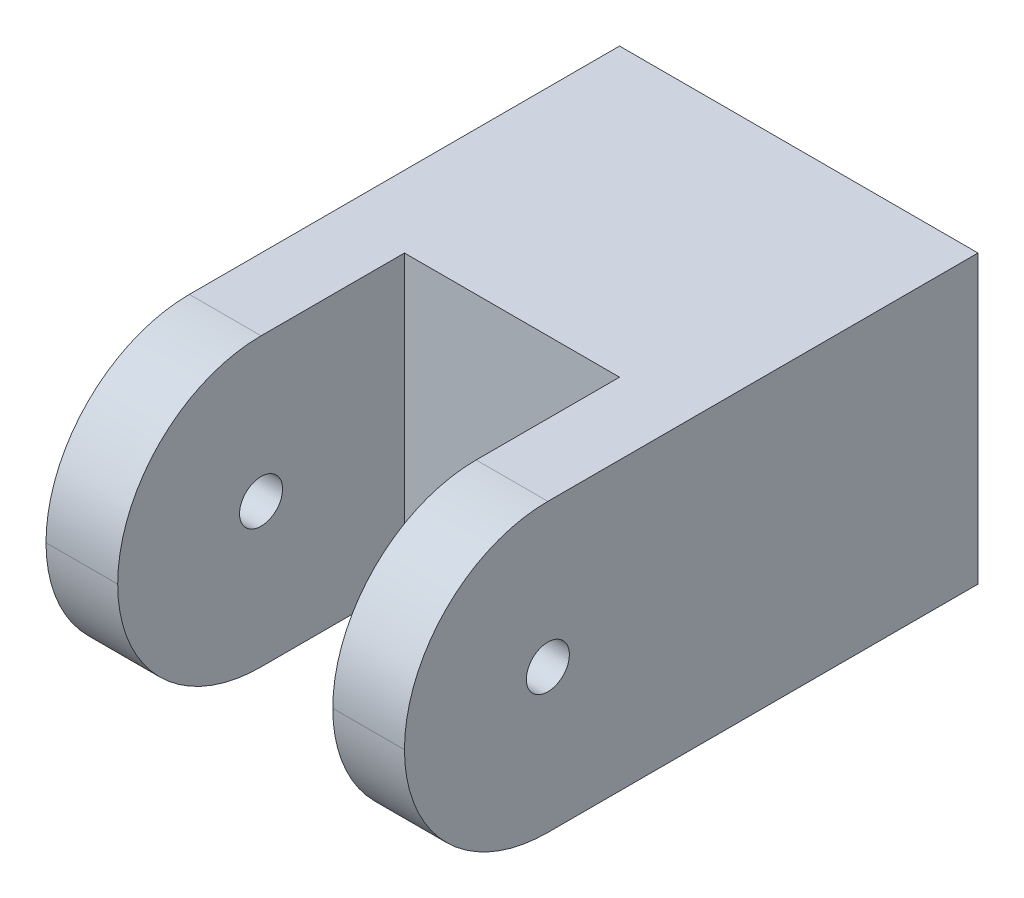
ISO-10303-21;
HEADER;
FILE_DESCRIPTION(('STEP AP214'),'2;1');
FILE_NAME('part.step','',(''),(''),'','','');
FILE_SCHEMA(('AUTOMOTIVE_DESIGN { 1 0 10303 214 1 1 1 1 }'));
ENDSEC;
DATA;
#1=APPLICATION_CONTEXT('core data for automotive mechanical design processes');
#2=APPLICATION_PROTOCOL_DEFINITION('international standard','automotive_design',2000,#1);
#3=PRODUCT_CONTEXT('',#1,'mechanical');
#4=PRODUCT('Part','Part','',(#3));
#5=PRODUCT_RELATED_PRODUCT_CATEGORY('part','',(#4));
#6=PRODUCT_DEFINITION_FORMATION('','',#4);
#7=PRODUCT_DEFINITION_CONTEXT('part definition',#1,'design');
#8=PRODUCT_DEFINITION('design','',#6,#7);
#9=PRODUCT_DEFINITION_SHAPE('','',#8);
#10=(LENGTH_UNIT() NAMED_UNIT(*) SI_UNIT(.MILLI.,.METRE.));
#11=(NAMED_UNIT(*) PLANE_ANGLE_UNIT() SI_UNIT($,.RADIAN.));
#12=(NAMED_UNIT(*) SI_UNIT($,.STERADIAN.) SOLID_ANGLE_UNIT());
#13=UNCERTAINTY_MEASURE_WITH_UNIT(LENGTH_MEASURE(1.E-05),#10,'distance_accuracy_value','');
#14=(GEOMETRIC_REPRESENTATION_CONTEXT(3) GLOBAL_UNCERTAINTY_ASSIGNED_CONTEXT((#13)) GLOBAL_UNIT_ASSIGNED_CONTEXT((#10,
#11,#12)) REPRESENTATION_CONTEXT('',''));
#15=CARTESIAN_POINT('',(0.,0.,0.));
#16=DIRECTION('',(0.,0.,1.));
#17=DIRECTION('',(1.,0.,0.));
#18=AXIS2_PLACEMENT_3D('',#15,#16,#17);
#19=CARTESIAN_POINT('',(-12.5,10.,40.));
#20=DIRECTION('',(1.,0.,0.));
#21=DIRECTION('',(0.,1.,0.));
#22=AXIS2_PLACEMENT_3D('',#19,#20,#21);
#23=PLANE('',#22);
#24=CARTESIAN_POINT('',(-12.5,0.,30.));
#25=DIRECTION('',(1.,0.,0.));
#26=DIRECTION('',(0.,1.,0.));
#27=AXIS2_PLACEMENT_3D('',#24,#25,#26);
#28=CIRCLE('',#27,1.5);
#29=CARTESIAN_POINT('',(-12.5,1.5,30.));
#30=VERTEX_POINT('',#29);
#31=EDGE_CURVE('E208',#30,#30,#28,.T.);
#32=ORIENTED_EDGE('',*,*,#31,.T.);
#33=EDGE_LOOP('',(#32));
#34=FACE_BOUND('',#33,.T.);
#35=CARTESIAN_POINT('',(-12.5,0.,30.));
#36=DIRECTION('',(1.,0.,0.));
#37=DIRECTION('',(0.,1.,0.));
#38=AXIS2_PLACEMENT_3D('',#35,#36,#37);
#39=CIRCLE('',#38,10.);
#40=CARTESIAN_POINT('',(-12.5,-10.,30.));
#41=VERTEX_POINT('',#40);
#42=CARTESIAN_POINT('',(-12.5,0.,40.));
#43=VERTEX_POINT('',#42);
#44=EDGE_CURVE('E289',#41,#43,#39,.F.);
#45=ORIENTED_EDGE('',*,*,#44,.T.);
#46=CARTESIAN_POINT('',(-12.5,0.,30.));
#47=DIRECTION('',(1.,0.,0.));
#48=DIRECTION('',(0.,1.,0.));
#49=AXIS2_PLACEMENT_3D('',#46,#47,#48);
#50=CIRCLE('',#49,10.);
#51=CARTESIAN_POINT('',(-12.5,10.,30.));
#52=VERTEX_POINT('',#51);
#53=EDGE_CURVE('E292',#43,#52,#50,.F.);
#54=ORIENTED_EDGE('',*,*,#53,.T.);
#55=DIRECTION('',(0.,0.,-1.));
#56=VECTOR('',#55,1.);
#57=CARTESIAN_POINT('',(-12.5,10.,40.));
#58=LINE('',#57,#56);
#59=CARTESIAN_POINT('',(-12.5,10.,0.));
#60=VERTEX_POINT('',#59);
#61=EDGE_CURVE('E260',#52,#60,#58,.T.);
#62=ORIENTED_EDGE('',*,*,#61,.T.);
#63=DIRECTION('',(0.,-1.,0.));
#64=VECTOR('',#63,1.);
#65=CARTESIAN_POINT('',(-12.5,10.,0.));
#66=LINE('',#65,#64);
#67=CARTESIAN_POINT('',(-12.5,-10.,0.));
#68=VERTEX_POINT('',#67);
#69=EDGE_CURVE('E233',#60,#68,#66,.T.);
#70=ORIENTED_EDGE('',*,*,#69,.T.);
#71=DIRECTION('',(0.,0.,-1.));
#72=VECTOR('',#71,1.);
#73=CARTESIAN_POINT('',(-12.5,-10.,40.));
#74=LINE('',#73,#72);
#75=EDGE_CURVE('E269',#41,#68,#74,.T.);
#76=ORIENTED_EDGE('',*,*,#75,.F.);
#77=EDGE_LOOP('',(#45,#54,#62,#70,#76));
#78=FACE_BOUND('',#77,.T.);
#79=ADVANCED_FACE('F43',(#34,#78),#23,.F.);
#80=CARTESIAN_POINT('',(-12.5,-10.,40.));
#81=DIRECTION('',(0.,1.,0.));
#82=DIRECTION('',(0.,0.,1.));
#83=AXIS2_PLACEMENT_3D('',#80,#81,#82);
#84=PLANE('',#83);
#85=DIRECTION('',(0.,0.,-1.));
#86=VECTOR('',#85,1.);
#87=CARTESIAN_POINT('',(12.5,-10.,40.));
#88=LINE('',#87,#86);
#89=CARTESIAN_POINT('',(12.5,-10.,30.));
#90=VERTEX_POINT('',#89);
#91=CARTESIAN_POINT('',(12.5,-10.,0.));
#92=VERTEX_POINT('',#91);
#93=EDGE_CURVE('E266',#90,#92,#88,.T.);
#94=ORIENTED_EDGE('',*,*,#93,.F.);
#95=DIRECTION('',(1.,0.,0.));
#96=VECTOR('',#95,1.);
#97=CARTESIAN_POINT('',(7.5,-10.,30.));
#98=LINE('',#97,#96);
#99=CARTESIAN_POINT('',(7.5,-10.,30.));
#100=VERTEX_POINT('',#99);
#101=EDGE_CURVE('E310',#90,#100,#98,.F.);
#102=ORIENTED_EDGE('',*,*,#101,.T.);
#103=DIRECTION('',(0.,0.,1.));
#104=VECTOR('',#103,1.);
#105=CARTESIAN_POINT('',(7.5,-10.,20.));
#106=LINE('',#105,#104);
#107=CARTESIAN_POINT('',(7.5,-10.,20.));
#108=VERTEX_POINT('',#107);
#109=EDGE_CURVE('E238',#108,#100,#106,.T.);
#110=ORIENTED_EDGE('',*,*,#109,.F.);
#111=DIRECTION('',(1.,0.,0.));
#112=VECTOR('',#111,1.);
#113=CARTESIAN_POINT('',(-7.5,-10.,20.));
#114=LINE('',#113,#112);
#115=CARTESIAN_POINT('',(-7.5,-10.,20.));
#116=VERTEX_POINT('',#115);
#117=EDGE_CURVE('E216',#116,#108,#114,.T.);
#118=ORIENTED_EDGE('',*,*,#117,.F.);
#119=DIRECTION('',(0.,0.,1.));
#120=VECTOR('',#119,1.);
#121=CARTESIAN_POINT('',(-7.5,-10.,20.));
#122=LINE('',#121,#120);
#123=CARTESIAN_POINT('',(-7.5,-10.,30.));
#124=VERTEX_POINT('',#123);
#125=EDGE_CURVE('E228',#116,#124,#122,.T.);
#126=ORIENTED_EDGE('',*,*,#125,.T.);
#127=DIRECTION('',(1.,0.,0.));
#128=VECTOR('',#127,1.);
#129=CARTESIAN_POINT('',(-12.5,-10.,30.));
#130=LINE('',#129,#128);
#131=EDGE_CURVE('E307',#124,#41,#130,.F.);
#132=ORIENTED_EDGE('',*,*,#131,.T.);
#133=ORIENTED_EDGE('',*,*,#75,.T.);
#134=DIRECTION('',(1.,0.,0.));
#135=VECTOR('',#134,1.);
#136=CARTESIAN_POINT('',(-12.5,-10.,0.));
#137=LINE('',#136,#135);
#138=EDGE_CURVE('E248',#68,#92,#137,.T.);
#139=ORIENTED_EDGE('',*,*,#138,.T.);
#140=EDGE_LOOP('',(#94,#102,#110,#118,#126,#132,#133,#139));
#141=FACE_BOUND('',#140,.T.);
#142=ADVANCED_FACE('F337',(#141),#84,.F.);
#143=CARTESIAN_POINT('',(12.5,10.,40.));
#144=DIRECTION('',(1.,0.,0.));
#145=DIRECTION('',(0.,1.,0.));
#146=AXIS2_PLACEMENT_3D('',#143,#144,#145);
#147=PLANE('',#146);
#148=CARTESIAN_POINT('',(12.5,0.,30.));
#149=DIRECTION('',(1.,0.,0.));
#150=DIRECTION('',(0.,1.,0.));
#151=AXIS2_PLACEMENT_3D('',#148,#149,#150);
#152=CIRCLE('',#151,1.5);
#153=CARTESIAN_POINT('',(12.5,1.5,30.));
#154=VERTEX_POINT('',#153);
#155=EDGE_CURVE('E198',#154,#154,#152,.T.);
#156=ORIENTED_EDGE('',*,*,#155,.F.);
#157=EDGE_LOOP('',(#156));
#158=FACE_BOUND('',#157,.T.);
#159=DIRECTION('',(0.,0.,-1.));
#160=VECTOR('',#159,1.);
#161=CARTESIAN_POINT('',(12.5,10.,40.));
#162=LINE('',#161,#160);
#163=CARTESIAN_POINT('',(12.5,10.,30.));
#164=VERTEX_POINT('',#163);
#165=CARTESIAN_POINT('',(12.5,10.,0.));
#166=VERTEX_POINT('',#165);
#167=EDGE_CURVE('E263',#164,#166,#162,.T.);
#168=ORIENTED_EDGE('',*,*,#167,.F.);
#169=CARTESIAN_POINT('',(12.5,0.,30.));
#170=DIRECTION('',(1.,0.,0.));
#171=DIRECTION('',(0.,1.,0.));
#172=AXIS2_PLACEMENT_3D('',#169,#170,#171);
#173=CIRCLE('',#172,10.);
#174=CARTESIAN_POINT('',(12.5,0.,40.));
#175=VERTEX_POINT('',#174);
#176=EDGE_CURVE('E298',#164,#175,#173,.T.);
#177=ORIENTED_EDGE('',*,*,#176,.T.);
#178=CARTESIAN_POINT('',(12.5,0.,30.));
#179=DIRECTION('',(1.,0.,0.));
#180=DIRECTION('',(0.,1.,0.));
#181=AXIS2_PLACEMENT_3D('',#178,#179,#180);
#182=CIRCLE('',#181,10.);
#183=EDGE_CURVE('E295',#175,#90,#182,.T.);
#184=ORIENTED_EDGE('',*,*,#183,.T.);
#185=ORIENTED_EDGE('',*,*,#93,.T.);
#186=DIRECTION('',(0.,-1.,0.));
#187=VECTOR('',#186,1.);
#188=CARTESIAN_POINT('',(12.5,10.,0.));
#189=LINE('',#188,#187);
#190=EDGE_CURVE('E252',#166,#92,#189,.T.);
#191=ORIENTED_EDGE('',*,*,#190,.F.);
#192=EDGE_LOOP('',(#168,#177,#184,#185,#191));
#193=FACE_BOUND('',#192,.T.);
#194=ADVANCED_FACE('F343',(#158,#193),#147,.T.);
#195=CARTESIAN_POINT('',(-12.5,10.,40.));
#196=DIRECTION('',(0.,1.,0.));
#197=DIRECTION('',(0.,0.,1.));
#198=AXIS2_PLACEMENT_3D('',#195,#196,#197);
#199=PLANE('',#198);
#200=ORIENTED_EDGE('',*,*,#61,.F.);
#201=DIRECTION('',(1.,0.,0.));
#202=VECTOR('',#201,1.);
#203=CARTESIAN_POINT('',(-12.5,10.,30.));
#204=LINE('',#203,#202);
#205=CARTESIAN_POINT('',(-7.5,10.,30.));
#206=VERTEX_POINT('',#205);
#207=EDGE_CURVE('E279',#52,#206,#204,.T.);
#208=ORIENTED_EDGE('',*,*,#207,.T.);
#209=DIRECTION('',(0.,0.,1.));
#210=VECTOR('',#209,1.);
#211=CARTESIAN_POINT('',(-7.5,10.,20.));
#212=LINE('',#211,#210);
#213=CARTESIAN_POINT('',(-7.5,10.,20.));
#214=VERTEX_POINT('',#213);
#215=EDGE_CURVE('E229',#214,#206,#212,.T.);
#216=ORIENTED_EDGE('',*,*,#215,.F.);
#217=DIRECTION('',(-1.,0.,0.));
#218=VECTOR('',#217,1.);
#219=CARTESIAN_POINT('',(-7.5,10.,20.));
#220=LINE('',#219,#218);
#221=CARTESIAN_POINT('',(7.5,10.,20.));
#222=VERTEX_POINT('',#221);
#223=EDGE_CURVE('E224',#222,#214,#220,.T.);
#224=ORIENTED_EDGE('',*,*,#223,.F.);
#225=DIRECTION('',(0.,0.,1.));
#226=VECTOR('',#225,1.);
#227=CARTESIAN_POINT('',(7.5,10.,20.));
#228=LINE('',#227,#226);
#229=CARTESIAN_POINT('',(7.5,10.,30.));
#230=VERTEX_POINT('',#229);
#231=EDGE_CURVE('E234',#222,#230,#228,.T.);
#232=ORIENTED_EDGE('',*,*,#231,.T.);
#233=DIRECTION('',(1.,0.,0.));
#234=VECTOR('',#233,1.);
#235=CARTESIAN_POINT('',(-12.5,10.,30.));
#236=LINE('',#235,#234);
#237=EDGE_CURVE('E272',#230,#164,#236,.T.);
#238=ORIENTED_EDGE('',*,*,#237,.T.);
#239=ORIENTED_EDGE('',*,*,#167,.T.);
#240=DIRECTION('',(1.,0.,0.));
#241=VECTOR('',#240,1.);
#242=CARTESIAN_POINT('',(-12.5,10.,0.));
#243=LINE('',#242,#241);
#244=EDGE_CURVE('E256',#60,#166,#243,.T.);
#245=ORIENTED_EDGE('',*,*,#244,.F.);
#246=EDGE_LOOP('',(#200,#208,#216,#224,#232,#238,#239,#245));
#247=FACE_BOUND('',#246,.T.);
#248=ADVANCED_FACE('F376',(#247),#199,.T.);
#249=CARTESIAN_POINT('',(0.,0.,0.));
#250=DIRECTION('',(0.,0.,1.));
#251=DIRECTION('',(1.,0.,0.));
#252=AXIS2_PLACEMENT_3D('',#249,#250,#251);
#253=PLANE('',#252);
#254=DIRECTION('',(1.,0.,0.));
#255=VECTOR('',#254,1.);
#256=CARTESIAN_POINT('',(-3.,-4.,0.));
#257=LINE('',#256,#255);
#258=CARTESIAN_POINT('',(-3.,-4.,0.));
#259=VERTEX_POINT('',#258);
#260=CARTESIAN_POINT('',(3.,-4.,0.));
#261=VERTEX_POINT('',#260);
#262=EDGE_CURVE('E154',#259,#261,#257,.T.);
#263=ORIENTED_EDGE('',*,*,#262,.T.);
#264=CARTESIAN_POINT('',(3.,-3.,0.));
#265=DIRECTION('',(0.,0.,1.));
#266=DIRECTION('',(1.,0.,0.));
#267=AXIS2_PLACEMENT_3D('',#264,#265,#266);
#268=CIRCLE('',#267,1.);
#269=CARTESIAN_POINT('',(3.,-2.,0.));
#270=VERTEX_POINT('',#269);
#271=EDGE_CURVE('E147',#261,#270,#268,.T.);
#272=ORIENTED_EDGE('',*,*,#271,.T.);
#273=DIRECTION('',(-1.,0.,0.));
#274=VECTOR('',#273,1.);
#275=CARTESIAN_POINT('',(-3.,-2.,0.));
#276=LINE('',#275,#274);
#277=CARTESIAN_POINT('',(-3.,-2.,0.));
#278=VERTEX_POINT('',#277);
#279=EDGE_CURVE('E157',#270,#278,#276,.T.);
#280=ORIENTED_EDGE('',*,*,#279,.T.);
#281=CARTESIAN_POINT('',(-3.,-3.,0.));
#282=DIRECTION('',(0.,0.,1.));
#283=DIRECTION('',(1.,0.,0.));
#284=AXIS2_PLACEMENT_3D('',#281,#282,#283);
#285=CIRCLE('',#284,1.);
#286=EDGE_CURVE('E59',#278,#259,#285,.T.);
#287=ORIENTED_EDGE('',*,*,#286,.T.);
#288=EDGE_LOOP('',(#263,#272,#280,#287));
#289=FACE_BOUND('',#288,.T.);
#290=CARTESIAN_POINT('',(0.,-7.,0.));
#291=DIRECTION('',(0.,0.,1.));
#292=DIRECTION('',(1.,0.,0.));
#293=AXIS2_PLACEMENT_3D('',#290,#291,#292);
#294=CIRCLE('',#293,1.5);
#295=CARTESIAN_POINT('',(1.5,-7.,0.));
#296=VERTEX_POINT('',#295);
#297=EDGE_CURVE('E188',#296,#296,#294,.T.);
#298=ORIENTED_EDGE('',*,*,#297,.T.);
#299=EDGE_LOOP('',(#298));
#300=FACE_BOUND('',#299,.T.);
#301=ORIENTED_EDGE('',*,*,#69,.F.);
#302=ORIENTED_EDGE('',*,*,#244,.T.);
#303=ORIENTED_EDGE('',*,*,#190,.T.);
#304=ORIENTED_EDGE('',*,*,#138,.F.);
#305=EDGE_LOOP('',(#301,#302,#303,#304));
#306=FACE_BOUND('',#305,.T.);
#307=ADVANCED_FACE('F162',(#289,#300,#306),#253,.F.);
#308=CARTESIAN_POINT('',(-7.5,10.,20.));
#309=DIRECTION('',(-1.,0.,0.));
#310=DIRECTION('',(0.,-1.,0.));
#311=AXIS2_PLACEMENT_3D('',#308,#309,#310);
#312=PLANE('',#311);
#313=CARTESIAN_POINT('',(-7.5,0.,30.));
#314=DIRECTION('',(-1.,0.,0.));
#315=DIRECTION('',(0.,-1.,0.));
#316=AXIS2_PLACEMENT_3D('',#313,#314,#315);
#317=CIRCLE('',#316,1.5);
#318=CARTESIAN_POINT('',(-7.5,-1.5,30.));
#319=VERTEX_POINT('',#318);
#320=EDGE_CURVE('E204',#319,#319,#317,.T.);
#321=ORIENTED_EDGE('',*,*,#320,.T.);
#322=EDGE_LOOP('',(#321));
#323=FACE_BOUND('',#322,.T.);
#324=ORIENTED_EDGE('',*,*,#215,.T.);
#325=CARTESIAN_POINT('',(-7.5,0.,30.));
#326=DIRECTION('',(-1.,0.,0.));
#327=DIRECTION('',(0.,-1.,0.));
#328=AXIS2_PLACEMENT_3D('',#325,#326,#327);
#329=CIRCLE('',#328,10.);
#330=CARTESIAN_POINT('',(-7.5,0.,40.));
#331=VERTEX_POINT('',#330);
#332=EDGE_CURVE('E286',#206,#331,#329,.F.);
#333=ORIENTED_EDGE('',*,*,#332,.T.);
#334=CARTESIAN_POINT('',(-7.5,0.,30.));
#335=DIRECTION('',(-1.,0.,0.));
#336=DIRECTION('',(0.,-1.,0.));
#337=AXIS2_PLACEMENT_3D('',#334,#335,#336);
#338=CIRCLE('',#337,10.);
#339=EDGE_CURVE('E283',#331,#124,#338,.F.);
#340=ORIENTED_EDGE('',*,*,#339,.T.);
#341=ORIENTED_EDGE('',*,*,#125,.F.);
#342=DIRECTION('',(0.,-1.,0.));
#343=VECTOR('',#342,1.);
#344=CARTESIAN_POINT('',(-7.5,10.,20.));
#345=LINE('',#344,#343);
#346=EDGE_CURVE('E212',#214,#116,#345,.T.);
#347=ORIENTED_EDGE('',*,*,#346,.F.);
#348=EDGE_LOOP('',(#324,#333,#340,#341,#347));
#349=FACE_BOUND('',#348,.T.);
#350=ADVANCED_FACE('F396',(#323,#349),#312,.F.);
#351=CARTESIAN_POINT('',(7.5,10.,20.));
#352=DIRECTION('',(1.,0.,0.));
#353=DIRECTION('',(0.,1.,0.));
#354=AXIS2_PLACEMENT_3D('',#351,#352,#353);
#355=PLANE('',#354);
#356=CARTESIAN_POINT('',(7.5,0.,30.));
#357=DIRECTION('',(1.,0.,0.));
#358=DIRECTION('',(0.,1.,0.));
#359=AXIS2_PLACEMENT_3D('',#356,#357,#358);
#360=CIRCLE('',#359,1.5);
#361=CARTESIAN_POINT('',(7.5,1.5,30.));
#362=VERTEX_POINT('',#361);
#363=EDGE_CURVE('E202',#362,#362,#360,.T.);
#364=ORIENTED_EDGE('',*,*,#363,.T.);
#365=EDGE_LOOP('',(#364));
#366=FACE_BOUND('',#365,.T.);
#367=CARTESIAN_POINT('',(7.5,0.,30.));
#368=DIRECTION('',(1.,0.,0.));
#369=DIRECTION('',(0.,1.,0.));
#370=AXIS2_PLACEMENT_3D('',#367,#368,#369);
#371=CIRCLE('',#370,10.);
#372=CARTESIAN_POINT('',(7.5,0.,40.));
#373=VERTEX_POINT('',#372);
#374=EDGE_CURVE('E301',#100,#373,#371,.F.);
#375=ORIENTED_EDGE('',*,*,#374,.T.);
#376=CARTESIAN_POINT('',(7.5,0.,30.));
#377=DIRECTION('',(1.,0.,0.));
#378=DIRECTION('',(0.,1.,0.));
#379=AXIS2_PLACEMENT_3D('',#376,#377,#378);
#380=CIRCLE('',#379,10.);
#381=EDGE_CURVE('E304',#373,#230,#380,.F.);
#382=ORIENTED_EDGE('',*,*,#381,.T.);
#383=ORIENTED_EDGE('',*,*,#231,.F.);
#384=DIRECTION('',(0.,1.,0.));
#385=VECTOR('',#384,1.);
#386=CARTESIAN_POINT('',(7.5,10.,20.));
#387=LINE('',#386,#385);
#388=EDGE_CURVE('E220',#108,#222,#387,.T.);
#389=ORIENTED_EDGE('',*,*,#388,.F.);
#390=ORIENTED_EDGE('',*,*,#109,.T.);
#391=EDGE_LOOP('',(#375,#382,#383,#389,#390));
#392=FACE_BOUND('',#391,.T.);
#393=ADVANCED_FACE('F372',(#366,#392),#355,.F.);
#394=CARTESIAN_POINT('',(0.,0.,20.));
#395=DIRECTION('',(0.,0.,1.));
#396=DIRECTION('',(1.,0.,0.));
#397=AXIS2_PLACEMENT_3D('',#394,#395,#396);
#398=PLANE('',#397);
#399=CARTESIAN_POINT('',(3.,-3.,20.));
#400=DIRECTION('',(0.,0.,1.));
#401=DIRECTION('',(1.,0.,0.));
#402=AXIS2_PLACEMENT_3D('',#399,#400,#401);
#403=CIRCLE('',#402,1.);
#404=CARTESIAN_POINT('',(3.,-4.,20.));
#405=VERTEX_POINT('',#404);
#406=CARTESIAN_POINT('',(3.,-2.,20.));
#407=VERTEX_POINT('',#406);
#408=EDGE_CURVE('E67',#405,#407,#403,.T.);
#409=ORIENTED_EDGE('',*,*,#408,.F.);
#410=DIRECTION('',(1.,0.,0.));
#411=VECTOR('',#410,1.);
#412=CARTESIAN_POINT('',(-3.,-4.,20.));
#413=LINE('',#412,#411);
#414=CARTESIAN_POINT('',(-3.,-4.,20.));
#415=VERTEX_POINT('',#414);
#416=EDGE_CURVE('E166',#415,#405,#413,.T.);
#417=ORIENTED_EDGE('',*,*,#416,.F.);
#418=CARTESIAN_POINT('',(-3.,-3.,20.));
#419=DIRECTION('',(0.,0.,1.));
#420=DIRECTION('',(1.,0.,0.));
#421=AXIS2_PLACEMENT_3D('',#418,#419,#420);
#422=CIRCLE('',#421,1.);
#423=CARTESIAN_POINT('',(-3.,-2.,20.));
#424=VERTEX_POINT('',#423);
#425=EDGE_CURVE('E170',#424,#415,#422,.T.);
#426=ORIENTED_EDGE('',*,*,#425,.F.);
#427=DIRECTION('',(-1.,0.,0.));
#428=VECTOR('',#427,1.);
#429=CARTESIAN_POINT('',(-3.,-2.,20.));
#430=LINE('',#429,#428);
#431=EDGE_CURVE('E179',#407,#424,#430,.T.);
#432=ORIENTED_EDGE('',*,*,#431,.F.);
#433=EDGE_LOOP('',(#409,#417,#426,#432));
#434=FACE_BOUND('',#433,.T.);
#435=CARTESIAN_POINT('',(0.,-7.,20.));
#436=DIRECTION('',(0.,0.,1.));
#437=DIRECTION('',(1.,0.,0.));
#438=AXIS2_PLACEMENT_3D('',#435,#436,#437);
#439=CIRCLE('',#438,2.5);
#440=CARTESIAN_POINT('',(2.5,-7.,20.));
#441=VERTEX_POINT('',#440);
#442=EDGE_CURVE('E11',#441,#441,#439,.F.);
#443=ORIENTED_EDGE('',*,*,#442,.T.);
#444=EDGE_LOOP('',(#443));
#445=FACE_BOUND('',#444,.T.);
#446=ORIENTED_EDGE('',*,*,#346,.T.);
#447=ORIENTED_EDGE('',*,*,#117,.T.);
#448=ORIENTED_EDGE('',*,*,#388,.T.);
#449=ORIENTED_EDGE('',*,*,#223,.T.);
#450=EDGE_LOOP('',(#446,#447,#448,#449));
#451=FACE_BOUND('',#450,.T.);
#452=ADVANCED_FACE('F380',(#434,#445,#451),#398,.T.);
#453=CARTESIAN_POINT('',(-17.5,0.,30.));
#454=DIRECTION('',(1.,0.,0.));
#455=DIRECTION('',(0.,1.,0.));
#456=AXIS2_PLACEMENT_3D('',#453,#454,#455);
#457=CYLINDRICAL_SURFACE('',#456,1.5);
#458=ORIENTED_EDGE('',*,*,#155,.T.);
#459=EDGE_LOOP('',(#458));
#460=FACE_BOUND('',#459,.T.);
#461=ORIENTED_EDGE('',*,*,#363,.F.);
#462=EDGE_LOOP('',(#461));
#463=FACE_BOUND('',#462,.T.);
#464=ADVANCED_FACE('F418',(#460,#463),#457,.F.);
#465=ORIENTED_EDGE('',*,*,#320,.F.);
#466=EDGE_LOOP('',(#465));
#467=FACE_BOUND('',#466,.T.);
#468=ORIENTED_EDGE('',*,*,#31,.F.);
#469=EDGE_LOOP('',(#468));
#470=FACE_BOUND('',#469,.T.);
#471=ADVANCED_FACE('F357',(#467,#470),#457,.F.);
#472=CARTESIAN_POINT('',(0.,0.,30.));
#473=DIRECTION('',(-1.,0.,0.));
#474=DIRECTION('',(0.,0.,1.));
#475=AXIS2_PLACEMENT_3D('',#472,#473,#474);
#476=CYLINDRICAL_SURFACE('',#475,10.);
#477=DIRECTION('',(1.,0.,0.));
#478=VECTOR('',#477,1.);
#479=CARTESIAN_POINT('',(-7.5,0.,40.));
#480=LINE('',#479,#478);
#481=EDGE_CURVE('E203',#43,#331,#480,.T.);
#482=ORIENTED_EDGE('',*,*,#481,.F.);
#483=ORIENTED_EDGE('',*,*,#44,.F.);
#484=ORIENTED_EDGE('',*,*,#131,.F.);
#485=ORIENTED_EDGE('',*,*,#339,.F.);
#486=EDGE_LOOP('',(#482,#483,#484,#485));
#487=FACE_BOUND('',#486,.T.);
#488=ADVANCED_FACE('F353',(#487),#476,.T.);
#489=CARTESIAN_POINT('',(-12.5,0.,30.));
#490=DIRECTION('',(1.,0.,0.));
#491=DIRECTION('',(0.,0.,-1.));
#492=AXIS2_PLACEMENT_3D('',#489,#490,#491);
#493=CYLINDRICAL_SURFACE('',#492,10.);
#494=ORIENTED_EDGE('',*,*,#53,.F.);
#495=ORIENTED_EDGE('',*,*,#481,.T.);
#496=ORIENTED_EDGE('',*,*,#332,.F.);
#497=ORIENTED_EDGE('',*,*,#207,.F.);
#498=EDGE_LOOP('',(#494,#495,#496,#497));
#499=FACE_BOUND('',#498,.T.);
#500=ADVANCED_FACE('F349',(#499),#493,.T.);
#501=CARTESIAN_POINT('',(0.,0.,30.));
#502=DIRECTION('',(-1.,0.,0.));
#503=DIRECTION('',(0.,0.,1.));
#504=AXIS2_PLACEMENT_3D('',#501,#502,#503);
#505=CYLINDRICAL_SURFACE('',#504,10.);
#506=DIRECTION('',(1.,0.,0.));
#507=VECTOR('',#506,1.);
#508=CARTESIAN_POINT('',(12.5,0.,40.));
#509=LINE('',#508,#507);
#510=EDGE_CURVE('E197',#373,#175,#509,.T.);
#511=ORIENTED_EDGE('',*,*,#510,.F.);
#512=ORIENTED_EDGE('',*,*,#374,.F.);
#513=ORIENTED_EDGE('',*,*,#101,.F.);
#514=ORIENTED_EDGE('',*,*,#183,.F.);
#515=EDGE_LOOP('',(#511,#512,#513,#514));
#516=FACE_BOUND('',#515,.T.);
#517=ADVANCED_FACE('F352',(#516),#505,.T.);
#518=CARTESIAN_POINT('',(-12.5,0.,30.));
#519=DIRECTION('',(1.,0.,0.));
#520=DIRECTION('',(0.,0.,-1.));
#521=AXIS2_PLACEMENT_3D('',#518,#519,#520);
#522=CYLINDRICAL_SURFACE('',#521,10.);
#523=ORIENTED_EDGE('',*,*,#381,.F.);
#524=ORIENTED_EDGE('',*,*,#510,.T.);
#525=ORIENTED_EDGE('',*,*,#176,.F.);
#526=ORIENTED_EDGE('',*,*,#237,.F.);
#527=EDGE_LOOP('',(#523,#524,#525,#526));
#528=FACE_BOUND('',#527,.T.);
#529=ADVANCED_FACE('F333',(#528),#522,.T.);
#530=CARTESIAN_POINT('',(0.,-7.,0.));
#531=DIRECTION('',(0.,0.,1.));
#532=DIRECTION('',(1.,0.,0.));
#533=AXIS2_PLACEMENT_3D('',#530,#531,#532);
#534=CYLINDRICAL_SURFACE('',#533,1.5);
#535=CARTESIAN_POINT('',(0.,-7.,19.));
#536=DIRECTION('',(0.,0.,1.));
#537=DIRECTION('',(1.,0.,0.));
#538=AXIS2_PLACEMENT_3D('',#535,#536,#537);
#539=CIRCLE('',#538,1.5);
#540=CARTESIAN_POINT('',(1.5,-7.,19.));
#541=VERTEX_POINT('',#540);
#542=EDGE_CURVE('E52',#541,#541,#539,.T.);
#543=ORIENTED_EDGE('',*,*,#542,.T.);
#544=EDGE_LOOP('',(#543));
#545=FACE_BOUND('',#544,.T.);
#546=ORIENTED_EDGE('',*,*,#297,.F.);
#547=EDGE_LOOP('',(#546));
#548=FACE_BOUND('',#547,.T.);
#549=ADVANCED_FACE('F322',(#545,#548),#534,.F.);
#550=CARTESIAN_POINT('',(0.,-7.,19.));
#551=DIRECTION('',(0.,0.,1.));
#552=DIRECTION('',(1.,0.,0.));
#553=AXIS2_PLACEMENT_3D('',#550,#551,#552);
#554=TOROIDAL_SURFACE('',#553,2.5,1.);
#555=ORIENTED_EDGE('',*,*,#442,.F.);
#556=EDGE_LOOP('',(#555));
#557=FACE_BOUND('',#556,.T.);
#558=ORIENTED_EDGE('',*,*,#542,.F.);
#559=EDGE_LOOP('',(#558));
#560=FACE_BOUND('',#559,.T.);
#561=ADVANCED_FACE('F45',(#557,#560),#554,.T.);
#562=CARTESIAN_POINT('',(3.,-3.,0.));
#563=DIRECTION('',(0.,0.,1.));
#564=DIRECTION('',(1.,0.,0.));
#565=AXIS2_PLACEMENT_3D('',#562,#563,#564);
#566=CYLINDRICAL_SURFACE('',#565,1.);
#567=ORIENTED_EDGE('',*,*,#408,.T.);
#568=DIRECTION('',(0.,0.,1.));
#569=VECTOR('',#568,1.);
#570=CARTESIAN_POINT('',(3.,-2.,0.));
#571=LINE('',#570,#569);
#572=EDGE_CURVE('E143',#270,#407,#571,.T.);
#573=ORIENTED_EDGE('',*,*,#572,.F.);
#574=ORIENTED_EDGE('',*,*,#271,.F.);
#575=DIRECTION('',(0.,0.,1.));
#576=VECTOR('',#575,1.);
#577=CARTESIAN_POINT('',(3.,-4.,0.));
#578=LINE('',#577,#576);
#579=EDGE_CURVE('E185',#261,#405,#578,.T.);
#580=ORIENTED_EDGE('',*,*,#579,.T.);
#581=EDGE_LOOP('',(#567,#573,#574,#580));
#582=FACE_BOUND('',#581,.T.);
#583=ADVANCED_FACE('F145',(#582),#566,.F.);
#584=CARTESIAN_POINT('',(-3.,-4.,0.));
#585=DIRECTION('',(0.,-1.,0.));
#586=DIRECTION('',(0.,0.,-1.));
#587=AXIS2_PLACEMENT_3D('',#584,#585,#586);
#588=PLANE('',#587);
#589=ORIENTED_EDGE('',*,*,#416,.T.);
#590=ORIENTED_EDGE('',*,*,#579,.F.);
#591=ORIENTED_EDGE('',*,*,#262,.F.);
#592=DIRECTION('',(0.,0.,1.));
#593=VECTOR('',#592,1.);
#594=CARTESIAN_POINT('',(-3.,-4.,0.));
#595=LINE('',#594,#593);
#596=EDGE_CURVE('E189',#259,#415,#595,.T.);
#597=ORIENTED_EDGE('',*,*,#596,.T.);
#598=EDGE_LOOP('',(#589,#590,#591,#597));
#599=FACE_BOUND('',#598,.T.);
#600=ADVANCED_FACE('F331',(#599),#588,.F.);
#601=CARTESIAN_POINT('',(-3.,-3.,0.));
#602=DIRECTION('',(0.,0.,1.));
#603=DIRECTION('',(1.,0.,0.));
#604=AXIS2_PLACEMENT_3D('',#601,#602,#603);
#605=CYLINDRICAL_SURFACE('',#604,1.);
#606=ORIENTED_EDGE('',*,*,#425,.T.);
#607=ORIENTED_EDGE('',*,*,#596,.F.);
#608=ORIENTED_EDGE('',*,*,#286,.F.);
#609=DIRECTION('',(0.,0.,1.));
#610=VECTOR('',#609,1.);
#611=CARTESIAN_POINT('',(-3.,-2.,0.));
#612=LINE('',#611,#610);
#613=EDGE_CURVE('E153',#278,#424,#612,.T.);
#614=ORIENTED_EDGE('',*,*,#613,.T.);
#615=EDGE_LOOP('',(#606,#607,#608,#614));
#616=FACE_BOUND('',#615,.T.);
#617=ADVANCED_FACE('F432',(#616),#605,.F.);
#618=CARTESIAN_POINT('',(-3.,-2.,0.));
#619=DIRECTION('',(0.,1.,0.));
#620=DIRECTION('',(-1.,0.,0.));
#621=AXIS2_PLACEMENT_3D('',#618,#619,#620);
#622=PLANE('',#621);
#623=ORIENTED_EDGE('',*,*,#431,.T.);
#624=ORIENTED_EDGE('',*,*,#613,.F.);
#625=ORIENTED_EDGE('',*,*,#279,.F.);
#626=ORIENTED_EDGE('',*,*,#572,.T.);
#627=EDGE_LOOP('',(#623,#624,#625,#626));
#628=FACE_BOUND('',#627,.T.);
#629=ADVANCED_FACE('F158',(#628),#622,.F.);
#630=CLOSED_SHELL('',(#79,#142,#194,#248,#307,#350,#393,#452,#464,#471,#488,#500,#517,#529,#549,
#561,#583,#600,#617,#629));
#631=MANIFOLD_SOLID_BREP('B2',#630);
#632=ADVANCED_BREP_SHAPE_REPRESENTATION('',(#18,#631),#14);
#633=SHAPE_DEFINITION_REPRESENTATION(#9,#632);
ENDSEC;
END-ISO-10303-21;
